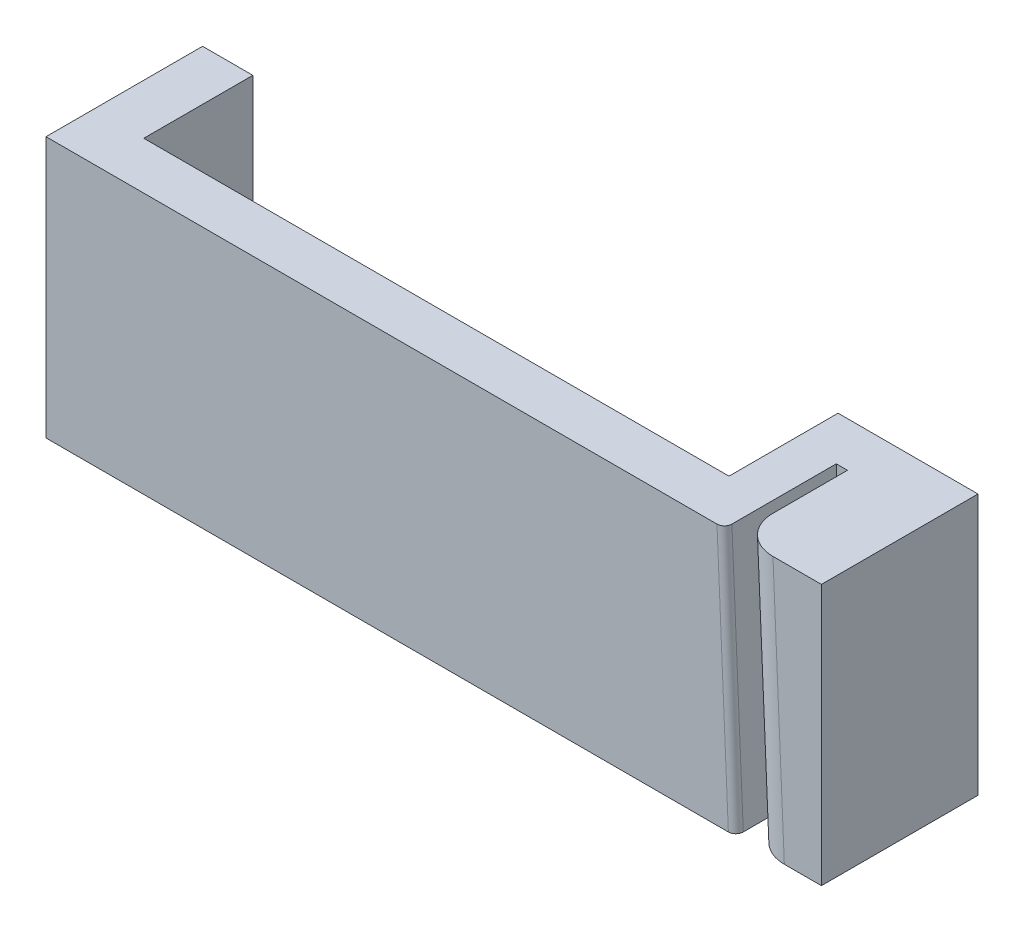
ISO-10303-21;
HEADER;
FILE_DESCRIPTION(('STEP AP214'),'2;1');
FILE_NAME('part.step','',(''),(''),'','','');
FILE_SCHEMA(('AUTOMOTIVE_DESIGN { 1 0 10303 214 1 1 1 1 }'));
ENDSEC;
DATA;
#1=APPLICATION_CONTEXT('core data for automotive mechanical design processes');
#2=APPLICATION_PROTOCOL_DEFINITION('international standard','automotive_design',2000,#1);
#3=PRODUCT_CONTEXT('',#1,'mechanical');
#4=PRODUCT('Part','Part','',(#3));
#5=PRODUCT_RELATED_PRODUCT_CATEGORY('part','',(#4));
#6=PRODUCT_DEFINITION_FORMATION('','',#4);
#7=PRODUCT_DEFINITION_CONTEXT('part definition',#1,'design');
#8=PRODUCT_DEFINITION('design','',#6,#7);
#9=PRODUCT_DEFINITION_SHAPE('','',#8);
#10=(LENGTH_UNIT() NAMED_UNIT(*) SI_UNIT(.MILLI.,.METRE.));
#11=(NAMED_UNIT(*) PLANE_ANGLE_UNIT() SI_UNIT($,.RADIAN.));
#12=(NAMED_UNIT(*) SI_UNIT($,.STERADIAN.) SOLID_ANGLE_UNIT());
#13=UNCERTAINTY_MEASURE_WITH_UNIT(LENGTH_MEASURE(1.E-05),#10,'distance_accuracy_value','');
#14=(GEOMETRIC_REPRESENTATION_CONTEXT(3) GLOBAL_UNCERTAINTY_ASSIGNED_CONTEXT((#13)) GLOBAL_UNIT_ASSIGNED_CONTEXT((#10,
#11,#12)) REPRESENTATION_CONTEXT('',''));
#15=CARTESIAN_POINT('',(0.,0.,0.));
#16=DIRECTION('',(0.,0.,1.));
#17=DIRECTION('',(1.,0.,0.));
#18=AXIS2_PLACEMENT_3D('',#15,#16,#17);
#19=CARTESIAN_POINT('',(-415.,-115.,-95.));
#20=DIRECTION('',(0.,-1.,0.));
#21=DIRECTION('',(0.,0.,-1.));
#22=AXIS2_PLACEMENT_3D('',#19,#20,#21);
#23=PLANE('',#22);
#24=DIRECTION('',(0.,0.,1.));
#25=VECTOR('',#24,1.);
#26=CARTESIAN_POINT('',(-208.,-115.,53.));
#27=LINE('',#26,#25);
#28=CARTESIAN_POINT('',(-208.,-115.,53.));
#29=VERTEX_POINT('',#28);
#30=CARTESIAN_POINT('',(-208.,-115.,95.));
#31=VERTEX_POINT('',#30);
#32=EDGE_CURVE('E55',#29,#31,#27,.T.);
#33=ORIENTED_EDGE('',*,*,#32,.F.);
#34=DIRECTION('',(-1.,0.,0.));
#35=VECTOR('',#34,1.);
#36=CARTESIAN_POINT('',(415.,-115.,53.));
#37=LINE('',#36,#35);
#38=CARTESIAN_POINT('',(-194.517914649905,-115.,53.));
#39=VERTEX_POINT('',#38);
#40=EDGE_CURVE('E152',#39,#29,#37,.T.);
#41=ORIENTED_EDGE('',*,*,#40,.F.);
#42=DIRECTION('',(0.,0.,1.));
#43=VECTOR('',#42,1.);
#44=CARTESIAN_POINT('',(-194.517914649905,-115.,0.));
#45=LINE('',#44,#43);
#46=CARTESIAN_POINT('',(-194.517914649905,-115.,82.2517643619484));
#47=VERTEX_POINT('',#46);
#48=EDGE_CURVE('E250',#39,#47,#45,.T.);
#49=ORIENTED_EDGE('',*,*,#48,.T.);
#50=DIRECTION('',(1.,0.,0.));
#51=VECTOR('',#50,1.);
#52=CARTESIAN_POINT('',(0.,-115.,82.2517643619484));
#53=LINE('',#52,#51);
#54=CARTESIAN_POINT('',(-37.5385449324378,-115.,82.2517643619484));
#55=VERTEX_POINT('',#54);
#56=EDGE_CURVE('E247',#47,#55,#53,.T.);
#57=ORIENTED_EDGE('',*,*,#56,.T.);
#58=DIRECTION('',(0.,0.,1.));
#59=VECTOR('',#58,1.);
#60=CARTESIAN_POINT('',(-37.5385449324378,-115.,0.));
#61=LINE('',#60,#59);
#62=CARTESIAN_POINT('',(-37.5385449324378,-115.,53.));
#63=VERTEX_POINT('',#62);
#64=EDGE_CURVE('E244',#63,#55,#61,.T.);
#65=ORIENTED_EDGE('',*,*,#64,.F.);
#66=CARTESIAN_POINT('',(0.,-115.,53.));
#67=VERTEX_POINT('',#66);
#68=EDGE_CURVE('E159',#67,#63,#37,.T.);
#69=ORIENTED_EDGE('',*,*,#68,.F.);
#70=DIRECTION('',(0.,0.,1.));
#71=VECTOR('',#70,1.);
#72=CARTESIAN_POINT('',(0.,-115.,53.));
#73=LINE('',#72,#71);
#74=CARTESIAN_POINT('',(0.,-115.,95.));
#75=VERTEX_POINT('',#74);
#76=EDGE_CURVE('E146',#67,#75,#73,.T.);
#77=ORIENTED_EDGE('',*,*,#76,.T.);
#78=DIRECTION('',(1.,0.,0.));
#79=VECTOR('',#78,1.);
#80=CARTESIAN_POINT('',(-415.,-115.,95.));
#81=LINE('',#80,#79);
#82=CARTESIAN_POINT('',(-9.94845627940982,-115.,95.));
#83=VERTEX_POINT('',#82);
#84=EDGE_CURVE('E168',#83,#75,#81,.T.);
#85=ORIENTED_EDGE('',*,*,#84,.F.);
#86=CARTESIAN_POINT('',(-9.94845627940983,-115.,85.));
#87=DIRECTION('',(0.,-1.,0.));
#88=DIRECTION('',(-1.,0.,0.));
#89=AXIS2_PLACEMENT_3D('',#86,#87,#88);
#90=ELLIPSE('',#89,10.0095268516332,10.);
#91=CARTESIAN_POINT('',(-19.957983131043,-115.,85.));
#92=VERTEX_POINT('',#91);
#93=EDGE_CURVE('E194',#83,#92,#90,.T.);
#94=ORIENTED_EDGE('',*,*,#93,.T.);
#95=DIRECTION('',(0.,0.,1.));
#96=VECTOR('',#95,1.);
#97=CARTESIAN_POINT('',(-19.957983131043,-115.,-38.7179852870251));
#98=LINE('',#97,#96);
#99=CARTESIAN_POINT('',(-19.957983131043,-115.,65.));
#100=VERTEX_POINT('',#99);
#101=EDGE_CURVE('E177',#100,#92,#98,.T.);
#102=ORIENTED_EDGE('',*,*,#101,.F.);
#103=DIRECTION('',(1.,0.,0.));
#104=VECTOR('',#103,1.);
#105=CARTESIAN_POINT('',(-22.960841186533,-115.,65.));
#106=LINE('',#105,#104);
#107=CARTESIAN_POINT('',(-22.960841186533,-115.,65.));
#108=VERTEX_POINT('',#107);
#109=EDGE_CURVE('E172',#108,#100,#106,.T.);
#110=ORIENTED_EDGE('',*,*,#109,.F.);
#111=DIRECTION('',(0.,0.,1.));
#112=VECTOR('',#111,1.);
#113=CARTESIAN_POINT('',(-22.960841186533,-115.,-38.7179852870251));
#114=LINE('',#113,#112);
#115=CARTESIAN_POINT('',(-22.960841186533,-115.,93.));
#116=VERTEX_POINT('',#115);
#117=EDGE_CURVE('E173',#108,#116,#114,.T.);
#118=ORIENTED_EDGE('',*,*,#117,.T.);
#119=CARTESIAN_POINT('',(-24.9627465568596,-115.,93.));
#120=DIRECTION('',(0.,-1.,0.));
#121=DIRECTION('',(1.,0.,0.));
#122=AXIS2_PLACEMENT_3D('',#119,#120,#121);
#123=ELLIPSE('',#122,2.00190537032664,2.);
#124=CARTESIAN_POINT('',(-24.9627465568596,-115.,95.));
#125=VERTEX_POINT('',#124);
#126=EDGE_CURVE('E184',#116,#125,#123,.T.);
#127=ORIENTED_EDGE('',*,*,#126,.T.);
#128=EDGE_CURVE('E154',#31,#125,#81,.T.);
#129=ORIENTED_EDGE('',*,*,#128,.F.);
#130=EDGE_LOOP('',(#33,#41,#49,#57,#65,#69,#77,#85,#94,#102,#110,#118,#127,#129));
#131=FACE_BOUND('',#130,.T.);
#132=ADVANCED_FACE('F40',(#131),#23,.T.);
#133=CARTESIAN_POINT('',(0.,0.,53.));
#134=DIRECTION('',(0.,0.,-1.));
#135=DIRECTION('',(-1.,0.,0.));
#136=AXIS2_PLACEMENT_3D('',#133,#134,#135);
#137=PLANE('',#136);
#138=DIRECTION('',(0.,-1.,0.));
#139=VECTOR('',#138,1.);
#140=CARTESIAN_POINT('',(0.,-115.,53.));
#141=LINE('',#140,#139);
#142=CARTESIAN_POINT('',(0.,-45.,53.));
#143=VERTEX_POINT('',#142);
#144=EDGE_CURVE('E314',#143,#67,#141,.T.);
#145=ORIENTED_EDGE('',*,*,#144,.T.);
#146=ORIENTED_EDGE('',*,*,#68,.T.);
#147=DIRECTION('',(0.,-1.,0.));
#148=VECTOR('',#147,1.);
#149=CARTESIAN_POINT('',(-37.5385449324378,-45.,53.));
#150=LINE('',#149,#148);
#151=CARTESIAN_POINT('',(-37.5385449324378,-45.,53.));
#152=VERTEX_POINT('',#151);
#153=EDGE_CURVE('E215',#152,#63,#150,.T.);
#154=ORIENTED_EDGE('',*,*,#153,.F.);
#155=DIRECTION('',(-1.,0.,0.));
#156=VECTOR('',#155,1.);
#157=CARTESIAN_POINT('',(0.,-45.,53.));
#158=LINE('',#157,#156);
#159=EDGE_CURVE('E160',#143,#152,#158,.T.);
#160=ORIENTED_EDGE('',*,*,#159,.F.);
#161=EDGE_LOOP('',(#145,#146,#154,#160));
#162=FACE_BOUND('',#161,.T.);
#163=ADVANCED_FACE('F273',(#162),#137,.T.);
#164=DIRECTION('',(0.,1.,0.));
#165=VECTOR('',#164,1.);
#166=CARTESIAN_POINT('',(-208.,-115.,53.));
#167=LINE('',#166,#165);
#168=CARTESIAN_POINT('',(-208.,-45.,53.));
#169=VERTEX_POINT('',#168);
#170=EDGE_CURVE('E138',#29,#169,#167,.T.);
#171=ORIENTED_EDGE('',*,*,#170,.T.);
#172=CARTESIAN_POINT('',(-194.517914649905,-45.,53.));
#173=VERTEX_POINT('',#172);
#174=EDGE_CURVE('E163',#173,#169,#158,.T.);
#175=ORIENTED_EDGE('',*,*,#174,.F.);
#176=DIRECTION('',(0.,-1.,0.));
#177=VECTOR('',#176,1.);
#178=CARTESIAN_POINT('',(-194.517914649905,-45.,53.));
#179=LINE('',#178,#177);
#180=EDGE_CURVE('E158',#173,#39,#179,.T.);
#181=ORIENTED_EDGE('',*,*,#180,.T.);
#182=ORIENTED_EDGE('',*,*,#40,.T.);
#183=EDGE_LOOP('',(#171,#175,#181,#182));
#184=FACE_BOUND('',#183,.T.);
#185=ADVANCED_FACE('F157',(#184),#137,.T.);
#186=CARTESIAN_POINT('',(0.,-45.,97.));
#187=DIRECTION('',(0.,-1.,0.));
#188=DIRECTION('',(1.,0.,0.));
#189=AXIS2_PLACEMENT_3D('',#186,#187,#188);
#190=PLANE('',#189);
#191=ORIENTED_EDGE('',*,*,#174,.T.);
#192=DIRECTION('',(0.,0.,1.));
#193=VECTOR('',#192,1.);
#194=CARTESIAN_POINT('',(-208.,-45.,53.));
#195=LINE('',#194,#193);
#196=CARTESIAN_POINT('',(-208.,-45.,95.));
#197=VERTEX_POINT('',#196);
#198=EDGE_CURVE('E141',#169,#197,#195,.T.);
#199=ORIENTED_EDGE('',*,*,#198,.T.);
#200=DIRECTION('',(-1.,0.,0.));
#201=VECTOR('',#200,1.);
#202=CARTESIAN_POINT('',(0.,-45.,95.));
#203=LINE('',#202,#201);
#204=CARTESIAN_POINT('',(-28.0190125604552,-45.,95.));
#205=VERTEX_POINT('',#204);
#206=EDGE_CURVE('E226',#205,#197,#203,.T.);
#207=ORIENTED_EDGE('',*,*,#206,.F.);
#208=CARTESIAN_POINT('',(-28.0190125604552,-45.,93.));
#209=DIRECTION('',(0.,-1.,0.));
#210=DIRECTION('',(1.,0.,0.));
#211=AXIS2_PLACEMENT_3D('',#208,#209,#210);
#212=ELLIPSE('',#211,2.00190537032664,2.);
#213=CARTESIAN_POINT('',(-26.0171071901286,-45.,93.));
#214=VERTEX_POINT('',#213);
#215=EDGE_CURVE('E225',#205,#214,#212,.F.);
#216=ORIENTED_EDGE('',*,*,#215,.T.);
#217=DIRECTION('',(0.,0.,1.));
#218=VECTOR('',#217,1.);
#219=CARTESIAN_POINT('',(-26.0171071901286,-45.,-38.7179852870251));
#220=LINE('',#219,#218);
#221=CARTESIAN_POINT('',(-26.0171071901286,-45.,65.));
#222=VERTEX_POINT('',#221);
#223=EDGE_CURVE('E222',#222,#214,#220,.T.);
#224=ORIENTED_EDGE('',*,*,#223,.F.);
#225=DIRECTION('',(1.,0.,0.));
#226=VECTOR('',#225,1.);
#227=CARTESIAN_POINT('',(0.,-45.,65.));
#228=LINE('',#227,#226);
#229=CARTESIAN_POINT('',(-23.0142491346386,-45.,65.));
#230=VERTEX_POINT('',#229);
#231=EDGE_CURVE('E220',#222,#230,#228,.T.);
#232=ORIENTED_EDGE('',*,*,#231,.T.);
#233=DIRECTION('',(0.,0.,-1.));
#234=VECTOR('',#233,1.);
#235=CARTESIAN_POINT('',(-23.0142491346386,-45.,65.));
#236=LINE('',#235,#234);
#237=CARTESIAN_POINT('',(-23.0142491346386,-45.,85.));
#238=VERTEX_POINT('',#237);
#239=EDGE_CURVE('E210',#238,#230,#236,.T.);
#240=ORIENTED_EDGE('',*,*,#239,.F.);
#241=CARTESIAN_POINT('',(-13.0047222830054,-45.,85.));
#242=DIRECTION('',(0.,-1.,0.));
#243=DIRECTION('',(-1.,0.,0.));
#244=AXIS2_PLACEMENT_3D('',#241,#242,#243);
#245=ELLIPSE('',#244,10.0095268516332,10.);
#246=CARTESIAN_POINT('',(-13.0047222830054,-45.,95.));
#247=VERTEX_POINT('',#246);
#248=EDGE_CURVE('E207',#238,#247,#245,.F.);
#249=ORIENTED_EDGE('',*,*,#248,.T.);
#250=DIRECTION('',(-1.,0.,0.));
#251=VECTOR('',#250,1.);
#252=CARTESIAN_POINT('',(0.,-45.,95.));
#253=LINE('',#252,#251);
#254=CARTESIAN_POINT('',(0.,-45.,95.));
#255=VERTEX_POINT('',#254);
#256=EDGE_CURVE('E199',#255,#247,#253,.T.);
#257=ORIENTED_EDGE('',*,*,#256,.F.);
#258=DIRECTION('',(0.,0.,1.));
#259=VECTOR('',#258,1.);
#260=CARTESIAN_POINT('',(0.,-45.,53.));
#261=LINE('',#260,#259);
#262=EDGE_CURVE('E62',#143,#255,#261,.T.);
#263=ORIENTED_EDGE('',*,*,#262,.F.);
#264=ORIENTED_EDGE('',*,*,#159,.T.);
#265=DIRECTION('',(0.,0.,1.));
#266=VECTOR('',#265,1.);
#267=CARTESIAN_POINT('',(-37.5385449324378,-45.,0.));
#268=LINE('',#267,#266);
#269=CARTESIAN_POINT('',(-37.5385449324378,-45.0000000000001,82.2517643619484));
#270=VERTEX_POINT('',#269);
#271=EDGE_CURVE('E240',#152,#270,#268,.T.);
#272=ORIENTED_EDGE('',*,*,#271,.T.);
#273=DIRECTION('',(1.,0.,0.));
#274=VECTOR('',#273,1.);
#275=CARTESIAN_POINT('',(0.,-45.,82.2517643619484));
#276=LINE('',#275,#274);
#277=CARTESIAN_POINT('',(-194.517914649905,-45.,82.2517643619484));
#278=VERTEX_POINT('',#277);
#279=EDGE_CURVE('E234',#278,#270,#276,.T.);
#280=ORIENTED_EDGE('',*,*,#279,.F.);
#281=DIRECTION('',(0.,0.,1.));
#282=VECTOR('',#281,1.);
#283=CARTESIAN_POINT('',(-194.517914649905,-45.,0.));
#284=LINE('',#283,#282);
#285=EDGE_CURVE('E231',#173,#278,#284,.T.);
#286=ORIENTED_EDGE('',*,*,#285,.F.);
#287=EDGE_LOOP('',(#191,#199,#207,#216,#224,#232,#240,#249,#257,#263,#264,#272,#280,#286));
#288=FACE_BOUND('',#287,.T.);
#289=ADVANCED_FACE('F204',(#288),#190,.F.);
#290=CARTESIAN_POINT('',(0.,0.,65.));
#291=DIRECTION('',(0.,0.,1.));
#292=DIRECTION('',(1.,0.,0.));
#293=AXIS2_PLACEMENT_3D('',#290,#291,#292);
#294=PLANE('',#293);
#295=ORIENTED_EDGE('',*,*,#231,.F.);
#296=DIRECTION('',(0.043619387365333,-0.999048221581858,0.));
#297=VECTOR('',#296,1.);
#298=CARTESIAN_POINT('',(-27.4587307919657,-11.9813910144352,65.));
#299=LINE('',#298,#297);
#300=EDGE_CURVE('E162',#222,#108,#299,.T.);
#301=ORIENTED_EDGE('',*,*,#300,.T.);
#302=ORIENTED_EDGE('',*,*,#109,.T.);
#303=DIRECTION('',(-0.0436193873653324,0.999048221581858,0.));
#304=VECTOR('',#303,1.);
#305=CARTESIAN_POINT('',(-30.,115.,65.));
#306=LINE('',#305,#304);
#307=EDGE_CURVE('E169',#100,#230,#306,.T.);
#308=ORIENTED_EDGE('',*,*,#307,.T.);
#309=EDGE_LOOP('',(#295,#301,#302,#308));
#310=FACE_BOUND('',#309,.T.);
#311=ADVANCED_FACE('F286',(#310),#294,.T.);
#312=CARTESIAN_POINT('',(0.,0.,95.));
#313=DIRECTION('',(0.,0.,-1.));
#314=DIRECTION('',(-1.,0.,0.));
#315=AXIS2_PLACEMENT_3D('',#312,#313,#314);
#316=PLANE('',#315);
#317=ORIENTED_EDGE('',*,*,#206,.T.);
#318=DIRECTION('',(0.,-1.,0.));
#319=VECTOR('',#318,1.);
#320=CARTESIAN_POINT('',(-208.,0.,95.));
#321=LINE('',#320,#319);
#322=EDGE_CURVE('E12',#197,#31,#321,.T.);
#323=ORIENTED_EDGE('',*,*,#322,.T.);
#324=ORIENTED_EDGE('',*,*,#128,.T.);
#325=DIRECTION('',(0.043619387365333,-0.999048221581858,0.));
#326=VECTOR('',#325,1.);
#327=CARTESIAN_POINT('',(-29.9267063712956,-1.30662821831685,95.));
#328=LINE('',#327,#326);
#329=EDGE_CURVE('E186',#125,#205,#328,.F.);
#330=ORIENTED_EDGE('',*,*,#329,.T.);
#331=EDGE_LOOP('',(#317,#323,#324,#330));
#332=FACE_BOUND('',#331,.T.);
#333=ADVANCED_FACE('F283',(#332),#316,.F.);
#334=ORIENTED_EDGE('',*,*,#84,.T.);
#335=DIRECTION('',(0.,1.,0.));
#336=VECTOR('',#335,1.);
#337=CARTESIAN_POINT('',(0.,0.,95.));
#338=LINE('',#337,#336);
#339=EDGE_CURVE('E48',#75,#255,#338,.T.);
#340=ORIENTED_EDGE('',*,*,#339,.T.);
#341=ORIENTED_EDGE('',*,*,#256,.T.);
#342=DIRECTION('',(-0.0436193873653324,0.999048221581858,0.));
#343=VECTOR('',#342,1.);
#344=CARTESIAN_POINT('',(-14.9409830475677,-0.652337407836844,95.));
#345=LINE('',#344,#343);
#346=EDGE_CURVE('E192',#247,#83,#345,.F.);
#347=ORIENTED_EDGE('',*,*,#346,.T.);
#348=EDGE_LOOP('',(#334,#340,#341,#347));
#349=FACE_BOUND('',#348,.T.);
#350=ADVANCED_FACE('F198',(#349),#316,.F.);
#351=CARTESIAN_POINT('',(-30.,115.,65.));
#352=DIRECTION('',(0.999048221581858,0.0436193873653324,0.));
#353=DIRECTION('',(-0.0436193873653324,0.999048221581858,0.));
#354=AXIS2_PLACEMENT_3D('',#351,#352,#353);
#355=PLANE('',#354);
#356=DIRECTION('',(-0.0436193873653324,0.999048221581858,0.));
#357=VECTOR('',#356,1.);
#358=CARTESIAN_POINT('',(-30.,115.,85.));
#359=LINE('',#358,#357);
#360=EDGE_CURVE('E189',#92,#238,#359,.T.);
#361=ORIENTED_EDGE('',*,*,#360,.T.);
#362=ORIENTED_EDGE('',*,*,#239,.T.);
#363=ORIENTED_EDGE('',*,*,#307,.F.);
#364=ORIENTED_EDGE('',*,*,#101,.T.);
#365=EDGE_LOOP('',(#361,#362,#363,#364));
#366=FACE_BOUND('',#365,.T.);
#367=ADVANCED_FACE('F287',(#366),#355,.F.);
#368=CARTESIAN_POINT('',(-27.4587307919657,-11.9813910144352,-38.7179852870251));
#369=DIRECTION('',(-0.999048221581858,-0.043619387365333,0.));
#370=DIRECTION('',(0.043619387365333,-0.999048221581858,0.));
#371=AXIS2_PLACEMENT_3D('',#368,#369,#370);
#372=PLANE('',#371);
#373=ORIENTED_EDGE('',*,*,#300,.F.);
#374=ORIENTED_EDGE('',*,*,#223,.T.);
#375=DIRECTION('',(0.043619387365333,-0.999048221581858,0.));
#376=VECTOR('',#375,1.);
#377=CARTESIAN_POINT('',(-27.4587307919657,-11.9813910144352,93.));
#378=LINE('',#377,#376);
#379=EDGE_CURVE('E176',#214,#116,#378,.T.);
#380=ORIENTED_EDGE('',*,*,#379,.T.);
#381=ORIENTED_EDGE('',*,*,#117,.F.);
#382=EDGE_LOOP('',(#373,#374,#380,#381));
#383=FACE_BOUND('',#382,.T.);
#384=ADVANCED_FACE('F290',(#383),#372,.F.);
#385=CARTESIAN_POINT('',(-29.4568272351294,-12.0686297891659,93.));
#386=DIRECTION('',(0.043619387365333,-0.999048221581858,0.));
#387=DIRECTION('',(0.999048221581858,0.043619387365333,0.));
#388=AXIS2_PLACEMENT_3D('',#385,#386,#387);
#389=CYLINDRICAL_SURFACE('',#388,2.);
#390=ORIENTED_EDGE('',*,*,#215,.F.);
#391=ORIENTED_EDGE('',*,*,#329,.F.);
#392=ORIENTED_EDGE('',*,*,#126,.F.);
#393=ORIENTED_EDGE('',*,*,#379,.F.);
#394=EDGE_LOOP('',(#390,#391,#392,#393));
#395=FACE_BOUND('',#394,.T.);
#396=ADVANCED_FACE('F269',(#395),#389,.T.);
#397=CARTESIAN_POINT('',(-20.0095177841814,115.436193873653,85.));
#398=DIRECTION('',(-0.0436193873653324,0.999048221581858,0.));
#399=DIRECTION('',(-0.999048221581858,-0.0436193873653324,0.));
#400=AXIS2_PLACEMENT_3D('',#397,#398,#399);
#401=CYLINDRICAL_SURFACE('',#400,10.);
#402=ORIENTED_EDGE('',*,*,#248,.F.);
#403=ORIENTED_EDGE('',*,*,#360,.F.);
#404=ORIENTED_EDGE('',*,*,#93,.F.);
#405=ORIENTED_EDGE('',*,*,#346,.F.);
#406=EDGE_LOOP('',(#402,#403,#404,#405));
#407=FACE_BOUND('',#406,.T.);
#408=ADVANCED_FACE('F42',(#407),#401,.T.);
#409=CARTESIAN_POINT('',(-194.517914649905,-45.,0.));
#410=DIRECTION('',(1.,0.,0.));
#411=DIRECTION('',(0.,0.,-1.));
#412=AXIS2_PLACEMENT_3D('',#409,#410,#411);
#413=PLANE('',#412);
#414=ORIENTED_EDGE('',*,*,#48,.F.);
#415=ORIENTED_EDGE('',*,*,#180,.F.);
#416=ORIENTED_EDGE('',*,*,#285,.T.);
#417=DIRECTION('',(0.,-1.,0.));
#418=VECTOR('',#417,1.);
#419=CARTESIAN_POINT('',(-194.517914649905,-45.,82.2517643619484));
#420=LINE('',#419,#418);
#421=EDGE_CURVE('E212',#278,#47,#420,.T.);
#422=ORIENTED_EDGE('',*,*,#421,.T.);
#423=EDGE_LOOP('',(#414,#415,#416,#422));
#424=FACE_BOUND('',#423,.T.);
#425=ADVANCED_FACE('F261',(#424),#413,.T.);
#426=CARTESIAN_POINT('',(0.,-45.,82.2517643619484));
#427=DIRECTION('',(0.,0.,-1.));
#428=DIRECTION('',(-1.,0.,0.));
#429=AXIS2_PLACEMENT_3D('',#426,#427,#428);
#430=PLANE('',#429);
#431=ORIENTED_EDGE('',*,*,#56,.F.);
#432=ORIENTED_EDGE('',*,*,#421,.F.);
#433=ORIENTED_EDGE('',*,*,#279,.T.);
#434=DIRECTION('',(0.,-1.,0.));
#435=VECTOR('',#434,1.);
#436=CARTESIAN_POINT('',(-37.5385449324378,-45.,82.2517643619484));
#437=LINE('',#436,#435);
#438=EDGE_CURVE('E239',#270,#55,#437,.T.);
#439=ORIENTED_EDGE('',*,*,#438,.T.);
#440=EDGE_LOOP('',(#431,#432,#433,#439));
#441=FACE_BOUND('',#440,.T.);
#442=ADVANCED_FACE('F254',(#441),#430,.T.);
#443=CARTESIAN_POINT('',(-37.5385449324378,-45.,0.));
#444=DIRECTION('',(1.,0.,0.));
#445=DIRECTION('',(0.,0.,-1.));
#446=AXIS2_PLACEMENT_3D('',#443,#444,#445);
#447=PLANE('',#446);
#448=ORIENTED_EDGE('',*,*,#64,.T.);
#449=ORIENTED_EDGE('',*,*,#438,.F.);
#450=ORIENTED_EDGE('',*,*,#271,.F.);
#451=ORIENTED_EDGE('',*,*,#153,.T.);
#452=EDGE_LOOP('',(#448,#449,#450,#451));
#453=FACE_BOUND('',#452,.T.);
#454=ADVANCED_FACE('F258',(#453),#447,.F.);
#455=CARTESIAN_POINT('',(0.,-115.,53.));
#456=DIRECTION('',(-1.,0.,0.));
#457=DIRECTION('',(0.,0.,1.));
#458=AXIS2_PLACEMENT_3D('',#455,#456,#457);
#459=PLANE('',#458);
#460=ORIENTED_EDGE('',*,*,#76,.F.);
#461=ORIENTED_EDGE('',*,*,#144,.F.);
#462=ORIENTED_EDGE('',*,*,#262,.T.);
#463=ORIENTED_EDGE('',*,*,#339,.F.);
#464=EDGE_LOOP('',(#460,#461,#462,#463));
#465=FACE_BOUND('',#464,.T.);
#466=ADVANCED_FACE('F317',(#465),#459,.F.);
#467=CARTESIAN_POINT('',(-208.,-115.,53.));
#468=DIRECTION('',(1.,0.,0.));
#469=DIRECTION('',(0.,0.,-1.));
#470=AXIS2_PLACEMENT_3D('',#467,#468,#469);
#471=PLANE('',#470);
#472=ORIENTED_EDGE('',*,*,#198,.F.);
#473=ORIENTED_EDGE('',*,*,#170,.F.);
#474=ORIENTED_EDGE('',*,*,#32,.T.);
#475=ORIENTED_EDGE('',*,*,#322,.F.);
#476=EDGE_LOOP('',(#472,#473,#474,#475));
#477=FACE_BOUND('',#476,.T.);
#478=ADVANCED_FACE('F139',(#477),#471,.F.);
#479=CLOSED_SHELL('',(#132,#163,#185,#289,#311,#333,#350,#367,#384,#396,#408,#425,#442,#454,
#466,#478));
#480=MANIFOLD_SOLID_BREP('B2',#479);
#481=ADVANCED_BREP_SHAPE_REPRESENTATION('',(#18,#480),#14);
#482=SHAPE_DEFINITION_REPRESENTATION(#9,#481);
ENDSEC;
END-ISO-10303-21;
